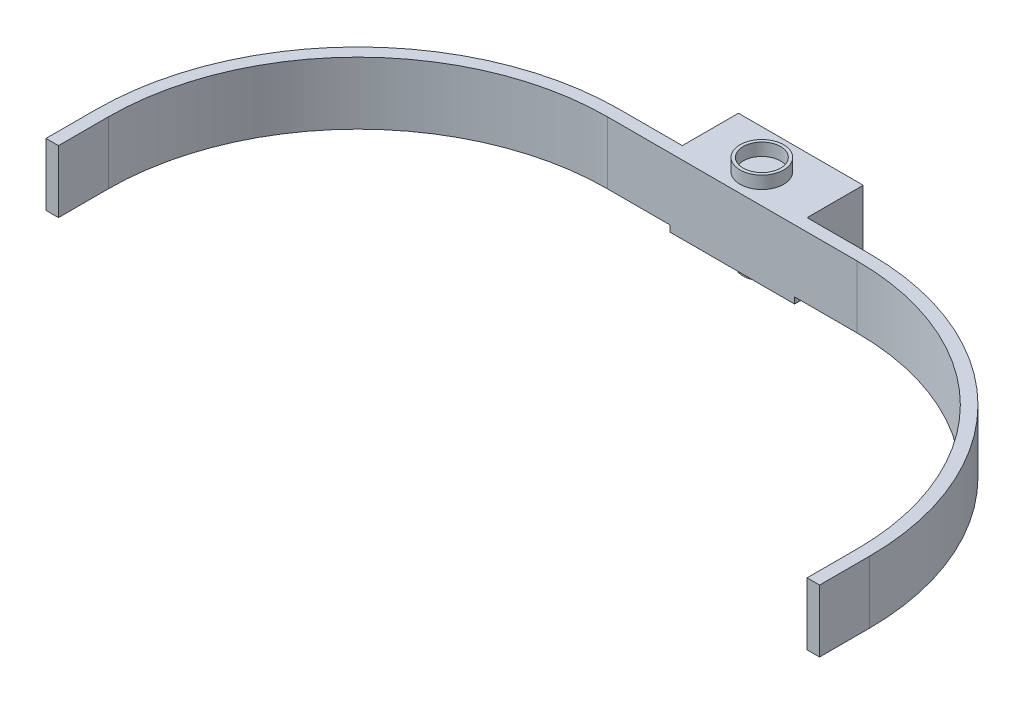
ISO-10303-21;
HEADER;
FILE_DESCRIPTION(('STEP AP214'),'2;1');
FILE_NAME('part.step','',(''),(''),'','','');
FILE_SCHEMA(('AUTOMOTIVE_DESIGN { 1 0 10303 214 1 1 1 1 }'));
ENDSEC;
DATA;
#1=APPLICATION_CONTEXT('core data for automotive mechanical design processes');
#2=APPLICATION_PROTOCOL_DEFINITION('international standard','automotive_design',2000,#1);
#3=PRODUCT_CONTEXT('',#1,'mechanical');
#4=PRODUCT('Part','Part','',(#3));
#5=PRODUCT_RELATED_PRODUCT_CATEGORY('part','',(#4));
#6=PRODUCT_DEFINITION_FORMATION('','',#4);
#7=PRODUCT_DEFINITION_CONTEXT('part definition',#1,'design');
#8=PRODUCT_DEFINITION('design','',#6,#7);
#9=PRODUCT_DEFINITION_SHAPE('','',#8);
#10=(LENGTH_UNIT() NAMED_UNIT(*) SI_UNIT(.MILLI.,.METRE.));
#11=(NAMED_UNIT(*) PLANE_ANGLE_UNIT() SI_UNIT($,.RADIAN.));
#12=(NAMED_UNIT(*) SI_UNIT($,.STERADIAN.) SOLID_ANGLE_UNIT());
#13=UNCERTAINTY_MEASURE_WITH_UNIT(LENGTH_MEASURE(1.E-05),#10,'distance_accuracy_value','');
#14=(GEOMETRIC_REPRESENTATION_CONTEXT(3) GLOBAL_UNCERTAINTY_ASSIGNED_CONTEXT((#13)) GLOBAL_UNIT_ASSIGNED_CONTEXT((#10,
#11,#12)) REPRESENTATION_CONTEXT('',''));
#15=CARTESIAN_POINT('',(0.,0.,0.));
#16=DIRECTION('',(0.,0.,1.));
#17=DIRECTION('',(1.,0.,0.));
#18=AXIS2_PLACEMENT_3D('',#15,#16,#17);
#19=CARTESIAN_POINT('',(-40.,21.,8.00000000000001));
#20=DIRECTION('',(0.,0.,1.));
#21=DIRECTION('',(0.,-1.,0.));
#22=AXIS2_PLACEMENT_3D('',#19,#20,#21);
#23=PLANE('',#22);
#24=DIRECTION('',(0.,-1.,0.));
#25=VECTOR('',#24,1.);
#26=CARTESIAN_POINT('',(-20.,21.,8.00000000000001));
#27=LINE('',#26,#25);
#28=CARTESIAN_POINT('',(-20.,21.,8.00000000000001));
#29=VERTEX_POINT('',#28);
#30=CARTESIAN_POINT('',(-20.,0.999999999999999,8.00000000000001));
#31=VERTEX_POINT('',#30);
#32=EDGE_CURVE('E68',#29,#31,#27,.T.);
#33=ORIENTED_EDGE('',*,*,#32,.T.);
#34=DIRECTION('',(-1.,0.,0.));
#35=VECTOR('',#34,1.);
#36=CARTESIAN_POINT('',(-40.,0.999999999999999,8.00000000000001));
#37=LINE('',#36,#35);
#38=CARTESIAN_POINT('',(-40.,0.999999999999999,8.00000000000001));
#39=VERTEX_POINT('',#38);
#40=EDGE_CURVE('E261',#31,#39,#37,.T.);
#41=ORIENTED_EDGE('',*,*,#40,.T.);
#42=DIRECTION('',(0.,-1.,0.));
#43=VECTOR('',#42,1.);
#44=CARTESIAN_POINT('',(-40.,21.,8.00000000000001));
#45=LINE('',#44,#43);
#46=CARTESIAN_POINT('',(-40.,21.,8.00000000000001));
#47=VERTEX_POINT('',#46);
#48=EDGE_CURVE('E214',#47,#39,#45,.T.);
#49=ORIENTED_EDGE('',*,*,#48,.F.);
#50=DIRECTION('',(-1.,0.,0.));
#51=VECTOR('',#50,1.);
#52=CARTESIAN_POINT('',(-40.,21.,8.00000000000001));
#53=LINE('',#52,#51);
#54=EDGE_CURVE('E215',#29,#47,#53,.T.);
#55=ORIENTED_EDGE('',*,*,#54,.F.);
#56=EDGE_LOOP('',(#33,#41,#49,#55));
#57=FACE_BOUND('',#56,.T.);
#58=ADVANCED_FACE('F51',(#57),#23,.F.);
#59=DIRECTION('',(0.,-1.,0.));
#60=VECTOR('',#59,1.);
#61=CARTESIAN_POINT('',(20.,21.,8.00000000000001));
#62=LINE('',#61,#60);
#63=CARTESIAN_POINT('',(20.,21.,8.00000000000001));
#64=VERTEX_POINT('',#63);
#65=CARTESIAN_POINT('',(20.,0.999999999999999,8.00000000000001));
#66=VERTEX_POINT('',#65);
#67=EDGE_CURVE('E187',#64,#66,#62,.T.);
#68=ORIENTED_EDGE('',*,*,#67,.F.);
#69=CARTESIAN_POINT('',(40.,21.,8.00000000000001));
#70=VERTEX_POINT('',#69);
#71=EDGE_CURVE('E203',#70,#64,#53,.T.);
#72=ORIENTED_EDGE('',*,*,#71,.F.);
#73=DIRECTION('',(0.,-1.,0.));
#74=VECTOR('',#73,1.);
#75=CARTESIAN_POINT('',(40.,21.,8.00000000000001));
#76=LINE('',#75,#74);
#77=CARTESIAN_POINT('',(40.,0.999999999999999,8.00000000000001));
#78=VERTEX_POINT('',#77);
#79=EDGE_CURVE('E220',#70,#78,#76,.T.);
#80=ORIENTED_EDGE('',*,*,#79,.T.);
#81=EDGE_CURVE('E205',#78,#66,#37,.T.);
#82=ORIENTED_EDGE('',*,*,#81,.T.);
#83=EDGE_LOOP('',(#68,#72,#80,#82));
#84=FACE_BOUND('',#83,.T.);
#85=ADVANCED_FACE('F201',(#84),#23,.F.);
#86=CARTESIAN_POINT('',(20.,0.999999999999999,12.));
#87=DIRECTION('',(0.,0.,-1.));
#88=DIRECTION('',(0.,1.,0.));
#89=AXIS2_PLACEMENT_3D('',#86,#87,#88);
#90=PLANE('',#89);
#91=DIRECTION('',(0.,-1.,0.));
#92=VECTOR('',#91,1.);
#93=CARTESIAN_POINT('',(-20.,0.999999999999999,12.));
#94=LINE('',#93,#92);
#95=CARTESIAN_POINT('',(-20.,0.999999999999999,12.));
#96=VERTEX_POINT('',#95);
#97=CARTESIAN_POINT('',(-20.,-1.,12.));
#98=VERTEX_POINT('',#97);
#99=EDGE_CURVE('E307',#96,#98,#94,.T.);
#100=ORIENTED_EDGE('',*,*,#99,.T.);
#101=DIRECTION('',(-1.,0.,0.));
#102=VECTOR('',#101,1.);
#103=CARTESIAN_POINT('',(20.,-1.,12.));
#104=LINE('',#103,#102);
#105=CARTESIAN_POINT('',(20.,-1.,12.));
#106=VERTEX_POINT('',#105);
#107=EDGE_CURVE('E331',#106,#98,#104,.T.);
#108=ORIENTED_EDGE('',*,*,#107,.F.);
#109=DIRECTION('',(0.,-1.,0.));
#110=VECTOR('',#109,1.);
#111=CARTESIAN_POINT('',(20.,0.999999999999999,12.));
#112=LINE('',#111,#110);
#113=CARTESIAN_POINT('',(20.,0.999999999999999,12.));
#114=VERTEX_POINT('',#113);
#115=EDGE_CURVE('E310',#114,#106,#112,.T.);
#116=ORIENTED_EDGE('',*,*,#115,.F.);
#117=DIRECTION('',(1.,0.,0.));
#118=VECTOR('',#117,1.);
#119=CARTESIAN_POINT('',(-40.,0.999999999999999,12.));
#120=LINE('',#119,#118);
#121=CARTESIAN_POINT('',(40.,0.999999999999999,12.));
#122=VERTEX_POINT('',#121);
#123=EDGE_CURVE('E241',#114,#122,#120,.T.);
#124=ORIENTED_EDGE('',*,*,#123,.T.);
#125=DIRECTION('',(0.,-1.,0.));
#126=VECTOR('',#125,1.);
#127=CARTESIAN_POINT('',(40.,21.,12.));
#128=LINE('',#127,#126);
#129=CARTESIAN_POINT('',(40.,21.,12.));
#130=VERTEX_POINT('',#129);
#131=EDGE_CURVE('E283',#130,#122,#128,.T.);
#132=ORIENTED_EDGE('',*,*,#131,.F.);
#133=DIRECTION('',(1.,0.,0.));
#134=VECTOR('',#133,1.);
#135=CARTESIAN_POINT('',(-40.,21.,12.));
#136=LINE('',#135,#134);
#137=CARTESIAN_POINT('',(-40.,21.,12.));
#138=VERTEX_POINT('',#137);
#139=EDGE_CURVE('E474',#138,#130,#136,.T.);
#140=ORIENTED_EDGE('',*,*,#139,.F.);
#141=DIRECTION('',(0.,-1.,0.));
#142=VECTOR('',#141,1.);
#143=CARTESIAN_POINT('',(-40.,21.,12.));
#144=LINE('',#143,#142);
#145=CARTESIAN_POINT('',(-40.,0.999999999999999,12.));
#146=VERTEX_POINT('',#145);
#147=EDGE_CURVE('E287',#138,#146,#144,.T.);
#148=ORIENTED_EDGE('',*,*,#147,.T.);
#149=EDGE_CURVE('E242',#146,#96,#120,.T.);
#150=ORIENTED_EDGE('',*,*,#149,.T.);
#151=EDGE_LOOP('',(#100,#108,#116,#124,#132,#140,#148,#150));
#152=FACE_BOUND('',#151,.T.);
#153=ADVANCED_FACE('F53',(#152),#90,.F.);
#154=CARTESIAN_POINT('',(20.,-1.,10.));
#155=DIRECTION('',(0.,1.,0.));
#156=DIRECTION('',(0.,0.,1.));
#157=AXIS2_PLACEMENT_3D('',#154,#155,#156);
#158=PLANE('',#157);
#159=CARTESIAN_POINT('',(0.,-1.,2.5));
#160=DIRECTION('',(0.,-1.,0.));
#161=DIRECTION('',(0.,0.,-1.));
#162=AXIS2_PLACEMENT_3D('',#159,#160,#161);
#163=CIRCLE('',#162,6.);
#164=CARTESIAN_POINT('',(0.,-1.,-3.5));
#165=VERTEX_POINT('',#164);
#166=EDGE_CURVE('E13',#165,#165,#163,.T.);
#167=ORIENTED_EDGE('',*,*,#166,.F.);
#168=EDGE_LOOP('',(#167));
#169=FACE_BOUND('',#168,.T.);
#170=DIRECTION('',(0.,0.,-1.));
#171=VECTOR('',#170,1.);
#172=CARTESIAN_POINT('',(-20.,-1.,10.));
#173=LINE('',#172,#171);
#174=CARTESIAN_POINT('',(-20.,-1.,-10.));
#175=VERTEX_POINT('',#174);
#176=EDGE_CURVE('E93',#98,#175,#173,.T.);
#177=ORIENTED_EDGE('',*,*,#176,.T.);
#178=DIRECTION('',(-1.,0.,0.));
#179=VECTOR('',#178,1.);
#180=CARTESIAN_POINT('',(20.,-1.,-10.));
#181=LINE('',#180,#179);
#182=CARTESIAN_POINT('',(20.,-1.,-10.));
#183=VERTEX_POINT('',#182);
#184=EDGE_CURVE('E318',#183,#175,#181,.T.);
#185=ORIENTED_EDGE('',*,*,#184,.F.);
#186=DIRECTION('',(0.,0.,-1.));
#187=VECTOR('',#186,1.);
#188=CARTESIAN_POINT('',(20.,-1.,10.));
#189=LINE('',#188,#187);
#190=EDGE_CURVE('E77',#106,#183,#189,.T.);
#191=ORIENTED_EDGE('',*,*,#190,.F.);
#192=ORIENTED_EDGE('',*,*,#107,.T.);
#193=EDGE_LOOP('',(#177,#185,#191,#192));
#194=FACE_BOUND('',#193,.T.);
#195=ADVANCED_FACE('F414',(#169,#194),#158,.F.);
#196=CARTESIAN_POINT('',(20.,1.,-10.));
#197=DIRECTION('',(0.,0.,1.));
#198=DIRECTION('',(1.,0.,0.));
#199=AXIS2_PLACEMENT_3D('',#196,#197,#198);
#200=PLANE('',#199);
#201=DIRECTION('',(0.,1.,0.));
#202=VECTOR('',#201,1.);
#203=CARTESIAN_POINT('',(-20.,1.,-10.));
#204=LINE('',#203,#202);
#205=CARTESIAN_POINT('',(-20.,21.,-10.));
#206=VERTEX_POINT('',#205);
#207=EDGE_CURVE('E324',#175,#206,#204,.T.);
#208=ORIENTED_EDGE('',*,*,#207,.T.);
#209=DIRECTION('',(-1.,0.,0.));
#210=VECTOR('',#209,1.);
#211=CARTESIAN_POINT('',(-20.,21.,-10.));
#212=LINE('',#211,#210);
#213=CARTESIAN_POINT('',(20.,21.,-10.));
#214=VERTEX_POINT('',#213);
#215=EDGE_CURVE('E195',#214,#206,#212,.T.);
#216=ORIENTED_EDGE('',*,*,#215,.F.);
#217=DIRECTION('',(0.,1.,0.));
#218=VECTOR('',#217,1.);
#219=CARTESIAN_POINT('',(20.,1.,-10.));
#220=LINE('',#219,#218);
#221=EDGE_CURVE('E189',#183,#214,#220,.T.);
#222=ORIENTED_EDGE('',*,*,#221,.F.);
#223=ORIENTED_EDGE('',*,*,#184,.T.);
#224=EDGE_LOOP('',(#208,#216,#222,#223));
#225=FACE_BOUND('',#224,.T.);
#226=ADVANCED_FACE('F410',(#225),#200,.F.);
#227=CARTESIAN_POINT('',(20.,0.,0.));
#228=DIRECTION('',(1.,0.,0.));
#229=DIRECTION('',(0.,0.,-1.));
#230=AXIS2_PLACEMENT_3D('',#227,#228,#229);
#231=PLANE('',#230);
#232=ORIENTED_EDGE('',*,*,#221,.T.);
#233=DIRECTION('',(0.,0.,-1.));
#234=VECTOR('',#233,1.);
#235=CARTESIAN_POINT('',(20.,21.,-10.));
#236=LINE('',#235,#234);
#237=EDGE_CURVE('E184',#64,#214,#236,.T.);
#238=ORIENTED_EDGE('',*,*,#237,.F.);
#239=ORIENTED_EDGE('',*,*,#67,.T.);
#240=DIRECTION('',(0.,0.,1.));
#241=VECTOR('',#240,1.);
#242=CARTESIAN_POINT('',(20.,0.999999999999999,9.99999999999999));
#243=LINE('',#242,#241);
#244=EDGE_CURVE('E98',#66,#114,#243,.T.);
#245=ORIENTED_EDGE('',*,*,#244,.T.);
#246=ORIENTED_EDGE('',*,*,#115,.T.);
#247=ORIENTED_EDGE('',*,*,#190,.T.);
#248=EDGE_LOOP('',(#232,#238,#239,#245,#246,#247));
#249=FACE_BOUND('',#248,.T.);
#250=ADVANCED_FACE('F186',(#249),#231,.T.);
#251=CARTESIAN_POINT('',(-20.,0.,0.));
#252=DIRECTION('',(1.,0.,0.));
#253=DIRECTION('',(0.,0.,-1.));
#254=AXIS2_PLACEMENT_3D('',#251,#252,#253);
#255=PLANE('',#254);
#256=ORIENTED_EDGE('',*,*,#99,.F.);
#257=DIRECTION('',(0.,0.,1.));
#258=VECTOR('',#257,1.);
#259=CARTESIAN_POINT('',(-20.,0.999999999999999,9.99999999999999));
#260=LINE('',#259,#258);
#261=EDGE_CURVE('E311',#31,#96,#260,.T.);
#262=ORIENTED_EDGE('',*,*,#261,.F.);
#263=ORIENTED_EDGE('',*,*,#32,.F.);
#264=DIRECTION('',(0.,0.,1.));
#265=VECTOR('',#264,1.);
#266=CARTESIAN_POINT('',(-20.,21.,-10.));
#267=LINE('',#266,#265);
#268=EDGE_CURVE('E196',#206,#29,#267,.T.);
#269=ORIENTED_EDGE('',*,*,#268,.F.);
#270=ORIENTED_EDGE('',*,*,#207,.F.);
#271=ORIENTED_EDGE('',*,*,#176,.F.);
#272=EDGE_LOOP('',(#256,#262,#263,#269,#270,#271));
#273=FACE_BOUND('',#272,.T.);
#274=ADVANCED_FACE('F409',(#273),#255,.F.);
#275=CARTESIAN_POINT('',(-40.,0.999999999999996,92.));
#276=DIRECTION('',(0.,1.,0.));
#277=DIRECTION('',(0.,0.,1.));
#278=AXIS2_PLACEMENT_3D('',#275,#276,#277);
#279=PLANE('',#278);
#280=ORIENTED_EDGE('',*,*,#40,.F.);
#281=ORIENTED_EDGE('',*,*,#261,.T.);
#282=ORIENTED_EDGE('',*,*,#149,.F.);
#283=CARTESIAN_POINT('',(-40.,0.999999999999996,92.));
#284=DIRECTION('',(0.,-1.,0.));
#285=DIRECTION('',(0.,0.,1.));
#286=AXIS2_PLACEMENT_3D('',#283,#284,#285);
#287=CIRCLE('',#286,80.);
#288=CARTESIAN_POINT('',(-120.,0.999999999999996,92.));
#289=VERTEX_POINT('',#288);
#290=EDGE_CURVE('E238',#289,#146,#287,.T.);
#291=ORIENTED_EDGE('',*,*,#290,.F.);
#292=DIRECTION('',(0.,0.,-1.));
#293=VECTOR('',#292,1.);
#294=CARTESIAN_POINT('',(-120.,0.999999999999996,92.));
#295=LINE('',#294,#293);
#296=CARTESIAN_POINT('',(-120.,0.999999999999996,108.));
#297=VERTEX_POINT('',#296);
#298=EDGE_CURVE('E235',#297,#289,#295,.T.);
#299=ORIENTED_EDGE('',*,*,#298,.F.);
#300=DIRECTION('',(1.,0.,0.));
#301=VECTOR('',#300,1.);
#302=CARTESIAN_POINT('',(-124.,0.999999999999996,108.));
#303=LINE('',#302,#301);
#304=CARTESIAN_POINT('',(-124.,0.999999999999996,108.));
#305=VERTEX_POINT('',#304);
#306=EDGE_CURVE('E232',#305,#297,#303,.T.);
#307=ORIENTED_EDGE('',*,*,#306,.F.);
#308=DIRECTION('',(0.,0.,1.));
#309=VECTOR('',#308,1.);
#310=CARTESIAN_POINT('',(-124.,0.999999999999996,92.));
#311=LINE('',#310,#309);
#312=CARTESIAN_POINT('',(-124.,0.999999999999996,92.));
#313=VERTEX_POINT('',#312);
#314=EDGE_CURVE('E229',#313,#305,#311,.T.);
#315=ORIENTED_EDGE('',*,*,#314,.F.);
#316=CARTESIAN_POINT('',(-40.,0.999999999999996,92.));
#317=DIRECTION('',(0.,1.,0.));
#318=DIRECTION('',(0.,0.,1.));
#319=AXIS2_PLACEMENT_3D('',#316,#317,#318);
#320=CIRCLE('',#319,84.);
#321=EDGE_CURVE('E225',#39,#313,#320,.T.);
#322=ORIENTED_EDGE('',*,*,#321,.F.);
#323=EDGE_LOOP('',(#280,#281,#282,#291,#299,#307,#315,#322));
#324=FACE_BOUND('',#323,.T.);
#325=ADVANCED_FACE('F405',(#324),#279,.F.);
#326=CARTESIAN_POINT('',(-40.,21.,92.));
#327=DIRECTION('',(0.,-1.,0.));
#328=DIRECTION('',(0.,0.,-1.));
#329=AXIS2_PLACEMENT_3D('',#326,#327,#328);
#330=CYLINDRICAL_SURFACE('',#329,84.);
#331=ORIENTED_EDGE('',*,*,#321,.T.);
#332=DIRECTION('',(0.,-1.,0.));
#333=VECTOR('',#332,1.);
#334=CARTESIAN_POINT('',(-124.,21.,92.));
#335=LINE('',#334,#333);
#336=CARTESIAN_POINT('',(-124.,21.,92.));
#337=VERTEX_POINT('',#336);
#338=EDGE_CURVE('E303',#337,#313,#335,.T.);
#339=ORIENTED_EDGE('',*,*,#338,.F.);
#340=CARTESIAN_POINT('',(-40.,21.,92.));
#341=DIRECTION('',(0.,1.,0.));
#342=DIRECTION('',(0.,0.,1.));
#343=AXIS2_PLACEMENT_3D('',#340,#341,#342);
#344=CIRCLE('',#343,84.);
#345=EDGE_CURVE('E263',#47,#337,#344,.T.);
#346=ORIENTED_EDGE('',*,*,#345,.F.);
#347=ORIENTED_EDGE('',*,*,#48,.T.);
#348=EDGE_LOOP('',(#331,#339,#346,#347));
#349=FACE_BOUND('',#348,.T.);
#350=ADVANCED_FACE('F401',(#349),#330,.T.);
#351=CARTESIAN_POINT('',(-124.,21.,92.));
#352=DIRECTION('',(1.,0.,0.));
#353=DIRECTION('',(0.,0.,-1.));
#354=AXIS2_PLACEMENT_3D('',#351,#352,#353);
#355=PLANE('',#354);
#356=ORIENTED_EDGE('',*,*,#314,.T.);
#357=DIRECTION('',(0.,-1.,0.));
#358=VECTOR('',#357,1.);
#359=CARTESIAN_POINT('',(-124.,21.,108.));
#360=LINE('',#359,#358);
#361=CARTESIAN_POINT('',(-124.,21.,108.));
#362=VERTEX_POINT('',#361);
#363=EDGE_CURVE('E299',#362,#305,#360,.T.);
#364=ORIENTED_EDGE('',*,*,#363,.F.);
#365=DIRECTION('',(0.,0.,1.));
#366=VECTOR('',#365,1.);
#367=CARTESIAN_POINT('',(-124.,21.,92.));
#368=LINE('',#367,#366);
#369=EDGE_CURVE('E462',#337,#362,#368,.T.);
#370=ORIENTED_EDGE('',*,*,#369,.F.);
#371=ORIENTED_EDGE('',*,*,#338,.T.);
#372=EDGE_LOOP('',(#356,#364,#370,#371));
#373=FACE_BOUND('',#372,.T.);
#374=ADVANCED_FACE('F397',(#373),#355,.F.);
#375=CARTESIAN_POINT('',(-124.,21.,108.));
#376=DIRECTION('',(0.,0.,-1.));
#377=DIRECTION('',(0.,1.,0.));
#378=AXIS2_PLACEMENT_3D('',#375,#376,#377);
#379=PLANE('',#378);
#380=ORIENTED_EDGE('',*,*,#306,.T.);
#381=DIRECTION('',(0.,-1.,0.));
#382=VECTOR('',#381,1.);
#383=CARTESIAN_POINT('',(-120.,21.,108.));
#384=LINE('',#383,#382);
#385=CARTESIAN_POINT('',(-120.,21.,108.));
#386=VERTEX_POINT('',#385);
#387=EDGE_CURVE('E295',#386,#297,#384,.T.);
#388=ORIENTED_EDGE('',*,*,#387,.F.);
#389=DIRECTION('',(1.,0.,0.));
#390=VECTOR('',#389,1.);
#391=CARTESIAN_POINT('',(-124.,21.,108.));
#392=LINE('',#391,#390);
#393=EDGE_CURVE('E465',#362,#386,#392,.T.);
#394=ORIENTED_EDGE('',*,*,#393,.F.);
#395=ORIENTED_EDGE('',*,*,#363,.T.);
#396=EDGE_LOOP('',(#380,#388,#394,#395));
#397=FACE_BOUND('',#396,.T.);
#398=ADVANCED_FACE('F393',(#397),#379,.F.);
#399=CARTESIAN_POINT('',(-120.,21.,92.));
#400=DIRECTION('',(-1.,0.,0.));
#401=DIRECTION('',(0.,0.,1.));
#402=AXIS2_PLACEMENT_3D('',#399,#400,#401);
#403=PLANE('',#402);
#404=ORIENTED_EDGE('',*,*,#298,.T.);
#405=DIRECTION('',(0.,-1.,0.));
#406=VECTOR('',#405,1.);
#407=CARTESIAN_POINT('',(-120.,21.,92.));
#408=LINE('',#407,#406);
#409=CARTESIAN_POINT('',(-120.,21.,92.));
#410=VERTEX_POINT('',#409);
#411=EDGE_CURVE('E291',#410,#289,#408,.T.);
#412=ORIENTED_EDGE('',*,*,#411,.F.);
#413=DIRECTION('',(0.,0.,-1.));
#414=VECTOR('',#413,1.);
#415=CARTESIAN_POINT('',(-120.,21.,92.));
#416=LINE('',#415,#414);
#417=EDGE_CURVE('E468',#386,#410,#416,.T.);
#418=ORIENTED_EDGE('',*,*,#417,.F.);
#419=ORIENTED_EDGE('',*,*,#387,.T.);
#420=EDGE_LOOP('',(#404,#412,#418,#419));
#421=FACE_BOUND('',#420,.T.);
#422=ADVANCED_FACE('F389',(#421),#403,.F.);
#423=CARTESIAN_POINT('',(-40.,21.,92.));
#424=DIRECTION('',(0.,-1.,0.));
#425=DIRECTION('',(0.,0.,-1.));
#426=AXIS2_PLACEMENT_3D('',#423,#424,#425);
#427=CYLINDRICAL_SURFACE('',#426,80.);
#428=ORIENTED_EDGE('',*,*,#290,.T.);
#429=ORIENTED_EDGE('',*,*,#147,.F.);
#430=CARTESIAN_POINT('',(-40.,21.,92.));
#431=DIRECTION('',(0.,-1.,0.));
#432=DIRECTION('',(0.,0.,1.));
#433=AXIS2_PLACEMENT_3D('',#430,#431,#432);
#434=CIRCLE('',#433,80.);
#435=EDGE_CURVE('E471',#410,#138,#434,.T.);
#436=ORIENTED_EDGE('',*,*,#435,.F.);
#437=ORIENTED_EDGE('',*,*,#411,.T.);
#438=EDGE_LOOP('',(#428,#429,#436,#437));
#439=FACE_BOUND('',#438,.T.);
#440=ADVANCED_FACE('F385',(#439),#427,.F.);
#441=CARTESIAN_POINT('',(40.,21.,92.));
#442=DIRECTION('',(0.,-1.,0.));
#443=DIRECTION('',(0.,0.,-1.));
#444=AXIS2_PLACEMENT_3D('',#441,#442,#443);
#445=CYLINDRICAL_SURFACE('',#444,80.);
#446=CARTESIAN_POINT('',(40.,0.999999999999996,92.));
#447=DIRECTION('',(0.,-1.,0.));
#448=DIRECTION('',(0.,0.,1.));
#449=AXIS2_PLACEMENT_3D('',#446,#447,#448);
#450=CIRCLE('',#449,80.);
#451=CARTESIAN_POINT('',(120.,0.999999999999996,92.));
#452=VERTEX_POINT('',#451);
#453=EDGE_CURVE('E246',#122,#452,#450,.T.);
#454=ORIENTED_EDGE('',*,*,#453,.T.);
#455=DIRECTION('',(0.,-1.,0.));
#456=VECTOR('',#455,1.);
#457=CARTESIAN_POINT('',(120.,21.,92.));
#458=LINE('',#457,#456);
#459=CARTESIAN_POINT('',(120.,21.,92.));
#460=VERTEX_POINT('',#459);
#461=EDGE_CURVE('E279',#460,#452,#458,.T.);
#462=ORIENTED_EDGE('',*,*,#461,.F.);
#463=CARTESIAN_POINT('',(40.,21.,92.));
#464=DIRECTION('',(0.,-1.,0.));
#465=DIRECTION('',(0.,0.,1.));
#466=AXIS2_PLACEMENT_3D('',#463,#464,#465);
#467=CIRCLE('',#466,80.);
#468=EDGE_CURVE('E477',#130,#460,#467,.T.);
#469=ORIENTED_EDGE('',*,*,#468,.F.);
#470=ORIENTED_EDGE('',*,*,#131,.T.);
#471=EDGE_LOOP('',(#454,#462,#469,#470));
#472=FACE_BOUND('',#471,.T.);
#473=ADVANCED_FACE('F381',(#472),#445,.F.);
#474=CARTESIAN_POINT('',(120.,21.,92.));
#475=DIRECTION('',(1.,0.,0.));
#476=DIRECTION('',(0.,0.,-1.));
#477=AXIS2_PLACEMENT_3D('',#474,#475,#476);
#478=PLANE('',#477);
#479=DIRECTION('',(0.,0.,1.));
#480=VECTOR('',#479,1.);
#481=CARTESIAN_POINT('',(120.,0.999999999999996,92.));
#482=LINE('',#481,#480);
#483=CARTESIAN_POINT('',(120.,0.999999999999996,108.));
#484=VERTEX_POINT('',#483);
#485=EDGE_CURVE('E249',#452,#484,#482,.T.);
#486=ORIENTED_EDGE('',*,*,#485,.T.);
#487=DIRECTION('',(0.,-1.,0.));
#488=VECTOR('',#487,1.);
#489=CARTESIAN_POINT('',(120.,21.,108.));
#490=LINE('',#489,#488);
#491=CARTESIAN_POINT('',(120.,21.,108.));
#492=VERTEX_POINT('',#491);
#493=EDGE_CURVE('E275',#492,#484,#490,.T.);
#494=ORIENTED_EDGE('',*,*,#493,.F.);
#495=DIRECTION('',(0.,0.,1.));
#496=VECTOR('',#495,1.);
#497=CARTESIAN_POINT('',(120.,21.,92.));
#498=LINE('',#497,#496);
#499=EDGE_CURVE('E480',#460,#492,#498,.T.);
#500=ORIENTED_EDGE('',*,*,#499,.F.);
#501=ORIENTED_EDGE('',*,*,#461,.T.);
#502=EDGE_LOOP('',(#486,#494,#500,#501));
#503=FACE_BOUND('',#502,.T.);
#504=ADVANCED_FACE('F377',(#503),#478,.F.);
#505=CARTESIAN_POINT('',(120.,21.,108.));
#506=DIRECTION('',(0.,0.,-1.));
#507=DIRECTION('',(0.,1.,0.));
#508=AXIS2_PLACEMENT_3D('',#505,#506,#507);
#509=PLANE('',#508);
#510=DIRECTION('',(1.,0.,0.));
#511=VECTOR('',#510,1.);
#512=CARTESIAN_POINT('',(120.,0.999999999999996,108.));
#513=LINE('',#512,#511);
#514=CARTESIAN_POINT('',(124.,0.999999999999996,108.));
#515=VERTEX_POINT('',#514);
#516=EDGE_CURVE('E252',#484,#515,#513,.T.);
#517=ORIENTED_EDGE('',*,*,#516,.T.);
#518=DIRECTION('',(0.,-1.,0.));
#519=VECTOR('',#518,1.);
#520=CARTESIAN_POINT('',(124.,21.,108.));
#521=LINE('',#520,#519);
#522=CARTESIAN_POINT('',(124.,21.,108.));
#523=VERTEX_POINT('',#522);
#524=EDGE_CURVE('E271',#523,#515,#521,.T.);
#525=ORIENTED_EDGE('',*,*,#524,.F.);
#526=DIRECTION('',(1.,0.,0.));
#527=VECTOR('',#526,1.);
#528=CARTESIAN_POINT('',(120.,21.,108.));
#529=LINE('',#528,#527);
#530=EDGE_CURVE('E483',#492,#523,#529,.T.);
#531=ORIENTED_EDGE('',*,*,#530,.F.);
#532=ORIENTED_EDGE('',*,*,#493,.T.);
#533=EDGE_LOOP('',(#517,#525,#531,#532));
#534=FACE_BOUND('',#533,.T.);
#535=ADVANCED_FACE('F373',(#534),#509,.F.);
#536=CARTESIAN_POINT('',(124.,21.,92.));
#537=DIRECTION('',(-1.,0.,0.));
#538=DIRECTION('',(0.,0.,1.));
#539=AXIS2_PLACEMENT_3D('',#536,#537,#538);
#540=PLANE('',#539);
#541=DIRECTION('',(0.,0.,-1.));
#542=VECTOR('',#541,1.);
#543=CARTESIAN_POINT('',(124.,0.999999999999996,92.));
#544=LINE('',#543,#542);
#545=CARTESIAN_POINT('',(124.,0.999999999999996,92.));
#546=VERTEX_POINT('',#545);
#547=EDGE_CURVE('E255',#515,#546,#544,.T.);
#548=ORIENTED_EDGE('',*,*,#547,.T.);
#549=DIRECTION('',(0.,-1.,0.));
#550=VECTOR('',#549,1.);
#551=CARTESIAN_POINT('',(124.,21.,92.));
#552=LINE('',#551,#550);
#553=CARTESIAN_POINT('',(124.,21.,92.));
#554=VERTEX_POINT('',#553);
#555=EDGE_CURVE('E267',#554,#546,#552,.T.);
#556=ORIENTED_EDGE('',*,*,#555,.F.);
#557=DIRECTION('',(0.,0.,-1.));
#558=VECTOR('',#557,1.);
#559=CARTESIAN_POINT('',(124.,21.,92.));
#560=LINE('',#559,#558);
#561=EDGE_CURVE('E485',#523,#554,#560,.T.);
#562=ORIENTED_EDGE('',*,*,#561,.F.);
#563=ORIENTED_EDGE('',*,*,#524,.T.);
#564=EDGE_LOOP('',(#548,#556,#562,#563));
#565=FACE_BOUND('',#564,.T.);
#566=ADVANCED_FACE('F369',(#565),#540,.F.);
#567=CARTESIAN_POINT('',(40.,21.,92.));
#568=DIRECTION('',(0.,-1.,0.));
#569=DIRECTION('',(0.,0.,-1.));
#570=AXIS2_PLACEMENT_3D('',#567,#568,#569);
#571=CYLINDRICAL_SURFACE('',#570,84.);
#572=CARTESIAN_POINT('',(40.,0.999999999999996,92.));
#573=DIRECTION('',(0.,1.,0.));
#574=DIRECTION('',(0.,0.,1.));
#575=AXIS2_PLACEMENT_3D('',#572,#573,#574);
#576=CIRCLE('',#575,84.);
#577=EDGE_CURVE('E258',#546,#78,#576,.T.);
#578=ORIENTED_EDGE('',*,*,#577,.T.);
#579=ORIENTED_EDGE('',*,*,#79,.F.);
#580=CARTESIAN_POINT('',(40.,21.,92.));
#581=DIRECTION('',(0.,1.,0.));
#582=DIRECTION('',(0.,0.,1.));
#583=AXIS2_PLACEMENT_3D('',#580,#581,#582);
#584=CIRCLE('',#583,84.);
#585=EDGE_CURVE('E211',#554,#70,#584,.T.);
#586=ORIENTED_EDGE('',*,*,#585,.F.);
#587=ORIENTED_EDGE('',*,*,#555,.T.);
#588=EDGE_LOOP('',(#578,#579,#586,#587));
#589=FACE_BOUND('',#588,.T.);
#590=ADVANCED_FACE('F358',(#589),#571,.T.);
#591=CARTESIAN_POINT('',(-40.,21.,92.));
#592=DIRECTION('',(0.,1.,0.));
#593=DIRECTION('',(0.,0.,1.));
#594=AXIS2_PLACEMENT_3D('',#591,#592,#593);
#595=PLANE('',#594);
#596=CARTESIAN_POINT('',(0.,21.,2.50000000000001));
#597=DIRECTION('',(0.,1.,0.));
#598=DIRECTION('',(0.,0.,1.));
#599=AXIS2_PLACEMENT_3D('',#596,#597,#598);
#600=CIRCLE('',#599,7.);
#601=CARTESIAN_POINT('',(0.,21.,9.50000000000001));
#602=VERTEX_POINT('',#601);
#603=EDGE_CURVE('E446',#602,#602,#600,.T.);
#604=ORIENTED_EDGE('',*,*,#603,.F.);
#605=EDGE_LOOP('',(#604));
#606=FACE_BOUND('',#605,.T.);
#607=ORIENTED_EDGE('',*,*,#345,.T.);
#608=ORIENTED_EDGE('',*,*,#369,.T.);
#609=ORIENTED_EDGE('',*,*,#393,.T.);
#610=ORIENTED_EDGE('',*,*,#417,.T.);
#611=ORIENTED_EDGE('',*,*,#435,.T.);
#612=ORIENTED_EDGE('',*,*,#139,.T.);
#613=ORIENTED_EDGE('',*,*,#468,.T.);
#614=ORIENTED_EDGE('',*,*,#499,.T.);
#615=ORIENTED_EDGE('',*,*,#530,.T.);
#616=ORIENTED_EDGE('',*,*,#561,.T.);
#617=ORIENTED_EDGE('',*,*,#585,.T.);
#618=ORIENTED_EDGE('',*,*,#71,.T.);
#619=ORIENTED_EDGE('',*,*,#237,.T.);
#620=ORIENTED_EDGE('',*,*,#215,.T.);
#621=ORIENTED_EDGE('',*,*,#268,.T.);
#622=ORIENTED_EDGE('',*,*,#54,.T.);
#623=EDGE_LOOP('',(#607,#608,#609,#610,#611,#612,#613,#614,#615,#616,#617,#618,#619,#620,#621,#622));
#624=FACE_BOUND('',#623,.T.);
#625=ADVANCED_FACE('F209',(#606,#624),#595,.T.);
#626=ORIENTED_EDGE('',*,*,#244,.F.);
#627=ORIENTED_EDGE('',*,*,#81,.F.);
#628=ORIENTED_EDGE('',*,*,#577,.F.);
#629=ORIENTED_EDGE('',*,*,#547,.F.);
#630=ORIENTED_EDGE('',*,*,#516,.F.);
#631=ORIENTED_EDGE('',*,*,#485,.F.);
#632=ORIENTED_EDGE('',*,*,#453,.F.);
#633=ORIENTED_EDGE('',*,*,#123,.F.);
#634=EDGE_LOOP('',(#626,#627,#628,#629,#630,#631,#632,#633));
#635=FACE_BOUND('',#634,.T.);
#636=ADVANCED_FACE('F357',(#635),#279,.F.);
#637=CARTESIAN_POINT('',(0.,25.,2.50000000000001));
#638=DIRECTION('',(0.,1.,0.));
#639=DIRECTION('',(0.,0.,1.));
#640=AXIS2_PLACEMENT_3D('',#637,#638,#639);
#641=PLANE('',#640);
#642=CARTESIAN_POINT('',(0.,25.,2.50000000000001));
#643=DIRECTION('',(0.,1.,0.));
#644=DIRECTION('',(0.,0.,1.));
#645=AXIS2_PLACEMENT_3D('',#642,#643,#644);
#646=CIRCLE('',#645,7.);
#647=CARTESIAN_POINT('',(0.,25.,9.50000000000001));
#648=VERTEX_POINT('',#647);
#649=EDGE_CURVE('E442',#648,#648,#646,.T.);
#650=ORIENTED_EDGE('',*,*,#649,.T.);
#651=EDGE_LOOP('',(#650));
#652=FACE_BOUND('',#651,.T.);
#653=CARTESIAN_POINT('',(0.,25.,2.50000000000001));
#654=DIRECTION('',(0.,1.,0.));
#655=DIRECTION('',(0.,0.,1.));
#656=AXIS2_PLACEMENT_3D('',#653,#654,#655);
#657=CIRCLE('',#656,6.);
#658=CARTESIAN_POINT('',(0.,25.,8.50000000000001));
#659=VERTEX_POINT('',#658);
#660=EDGE_CURVE('E450',#659,#659,#657,.T.);
#661=ORIENTED_EDGE('',*,*,#660,.F.);
#662=EDGE_LOOP('',(#661));
#663=FACE_BOUND('',#662,.T.);
#664=ADVANCED_FACE('F518',(#652,#663),#641,.T.);
#665=CARTESIAN_POINT('',(0.,25.,2.50000000000001));
#666=DIRECTION('',(0.,-1.,0.));
#667=DIRECTION('',(0.,0.,-1.));
#668=AXIS2_PLACEMENT_3D('',#665,#666,#667);
#669=CYLINDRICAL_SURFACE('',#668,7.);
#670=ORIENTED_EDGE('',*,*,#649,.F.);
#671=EDGE_LOOP('',(#670));
#672=FACE_BOUND('',#671,.T.);
#673=ORIENTED_EDGE('',*,*,#603,.T.);
#674=EDGE_LOOP('',(#673));
#675=FACE_BOUND('',#674,.T.);
#676=ADVANCED_FACE('F351',(#672,#675),#669,.T.);
#677=CARTESIAN_POINT('',(0.,25.,2.50000000000001));
#678=DIRECTION('',(0.,-1.,0.));
#679=DIRECTION('',(0.,0.,-1.));
#680=AXIS2_PLACEMENT_3D('',#677,#678,#679);
#681=CYLINDRICAL_SURFACE('',#680,6.);
#682=ORIENTED_EDGE('',*,*,#660,.T.);
#683=EDGE_LOOP('',(#682));
#684=FACE_BOUND('',#683,.T.);
#685=CARTESIAN_POINT('',(0.,21.,2.50000000000001));
#686=DIRECTION('',(0.,1.,0.));
#687=DIRECTION('',(0.,0.,1.));
#688=AXIS2_PLACEMENT_3D('',#685,#686,#687);
#689=CIRCLE('',#688,6.);
#690=CARTESIAN_POINT('',(0.,21.,8.50000000000001));
#691=VERTEX_POINT('',#690);
#692=EDGE_CURVE('E55',#691,#691,#689,.F.);
#693=ORIENTED_EDGE('',*,*,#692,.T.);
#694=EDGE_LOOP('',(#693));
#695=FACE_BOUND('',#694,.T.);
#696=ADVANCED_FACE('F338',(#684,#695),#681,.F.);
#697=ORIENTED_EDGE('',*,*,#692,.F.);
#698=EDGE_LOOP('',(#697));
#699=FACE_BOUND('',#698,.T.);
#700=ADVANCED_FACE('F340',(#699),#595,.T.);
#701=CARTESIAN_POINT('',(0.,-5.,2.5));
#702=DIRECTION('',(0.,1.,0.));
#703=DIRECTION('',(0.,0.,1.));
#704=AXIS2_PLACEMENT_3D('',#701,#702,#703);
#705=CYLINDRICAL_SURFACE('',#704,6.);
#706=CARTESIAN_POINT('',(0.,-5.,2.5));
#707=DIRECTION('',(0.,-1.,0.));
#708=DIRECTION('',(0.,0.,-1.));
#709=AXIS2_PLACEMENT_3D('',#706,#707,#708);
#710=CIRCLE('',#709,6.);
#711=CARTESIAN_POINT('',(0.,-5.,-3.5));
#712=VERTEX_POINT('',#711);
#713=EDGE_CURVE('E454',#712,#712,#710,.T.);
#714=ORIENTED_EDGE('',*,*,#713,.F.);
#715=EDGE_LOOP('',(#714));
#716=FACE_BOUND('',#715,.T.);
#717=ORIENTED_EDGE('',*,*,#166,.T.);
#718=EDGE_LOOP('',(#717));
#719=FACE_BOUND('',#718,.T.);
#720=ADVANCED_FACE('F342',(#716,#719),#705,.T.);
#721=CARTESIAN_POINT('',(0.,-5.,2.5));
#722=DIRECTION('',(0.,-1.,0.));
#723=DIRECTION('',(0.,0.,-1.));
#724=AXIS2_PLACEMENT_3D('',#721,#722,#723);
#725=PLANE('',#724);
#726=ORIENTED_EDGE('',*,*,#713,.T.);
#727=EDGE_LOOP('',(#726));
#728=FACE_BOUND('',#727,.T.);
#729=ADVANCED_FACE('F348',(#728),#725,.T.);
#730=CLOSED_SHELL('',(#58,#85,#153,#195,#226,#250,#274,#325,#350,#374,#398,#422,#440,#473,#504,
#535,#566,#590,#625,#636,#664,#676,#696,#700,#720,#729));
#731=MANIFOLD_SOLID_BREP('B2',#730);
#732=ADVANCED_BREP_SHAPE_REPRESENTATION('',(#18,#731),#14);
#733=SHAPE_DEFINITION_REPRESENTATION(#9,#732);
ENDSEC;
END-ISO-10303-21;
